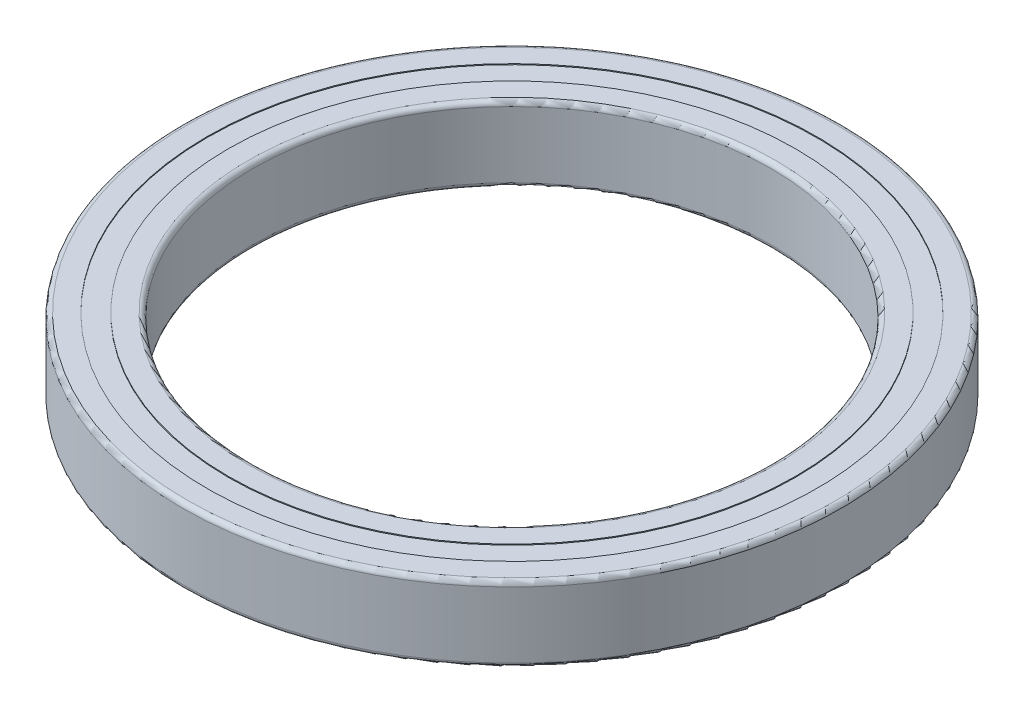
ISO-10303-21;
HEADER;
FILE_DESCRIPTION(('STEP AP214'),'2;1');
FILE_NAME('part.step','',(''),(''),'','','');
FILE_SCHEMA(('AUTOMOTIVE_DESIGN { 1 0 10303 214 1 1 1 1 }'));
ENDSEC;
DATA;
#1=APPLICATION_CONTEXT('core data for automotive mechanical design processes');
#2=APPLICATION_PROTOCOL_DEFINITION('international standard','automotive_design',2000,#1);
#3=PRODUCT_CONTEXT('',#1,'mechanical');
#4=PRODUCT('Part','Part','',(#3));
#5=PRODUCT_RELATED_PRODUCT_CATEGORY('part','',(#4));
#6=PRODUCT_DEFINITION_FORMATION('','',#4);
#7=PRODUCT_DEFINITION_CONTEXT('part definition',#1,'design');
#8=PRODUCT_DEFINITION('design','',#6,#7);
#9=PRODUCT_DEFINITION_SHAPE('','',#8);
#10=(LENGTH_UNIT() NAMED_UNIT(*) SI_UNIT(.MILLI.,.METRE.));
#11=(NAMED_UNIT(*) PLANE_ANGLE_UNIT() SI_UNIT($,.RADIAN.));
#12=(NAMED_UNIT(*) SI_UNIT($,.STERADIAN.) SOLID_ANGLE_UNIT());
#13=UNCERTAINTY_MEASURE_WITH_UNIT(LENGTH_MEASURE(1.E-05),#10,'distance_accuracy_value','');
#14=(GEOMETRIC_REPRESENTATION_CONTEXT(3) GLOBAL_UNCERTAINTY_ASSIGNED_CONTEXT((#13)) GLOBAL_UNIT_ASSIGNED_CONTEXT((#10,
#11,#12)) REPRESENTATION_CONTEXT('',''));
#15=CARTESIAN_POINT('',(0.,0.,0.));
#16=DIRECTION('',(0.,0.,1.));
#17=DIRECTION('',(1.,0.,0.));
#18=AXIS2_PLACEMENT_3D('',#15,#16,#17);
#19=CARTESIAN_POINT('',(0.,0.199999999999996,0.));
#20=DIRECTION('',(0.,1.,0.));
#21=DIRECTION('',(-1.,0.,0.));
#22=AXIS2_PLACEMENT_3D('',#19,#20,#21);
#23=CYLINDRICAL_SURFACE('',#22,64.75);
#24=CARTESIAN_POINT('',(0.,-15.8,0.));
#25=DIRECTION('',(0.,1.,0.));
#26=DIRECTION('',(-1.,0.,0.));
#27=AXIS2_PLACEMENT_3D('',#24,#25,#26);
#28=CIRCLE('',#27,64.75);
#29=CARTESIAN_POINT('',(-64.75,-15.8,0.));
#30=VERTEX_POINT('',#29);
#31=EDGE_CURVE('P0_E11',#30,#30,#28,.T.);
#32=ORIENTED_EDGE('',*,*,#31,.T.);
#33=EDGE_LOOP('',(#32));
#34=FACE_BOUND('',#33,.T.);
#35=CARTESIAN_POINT('',(0.,-15.3,0.));
#36=DIRECTION('',(0.,1.,0.));
#37=DIRECTION('',(-1.,0.,0.));
#38=AXIS2_PLACEMENT_3D('',#35,#36,#37);
#39=CIRCLE('',#38,64.75);
#40=CARTESIAN_POINT('',(-64.75,-15.3,0.));
#41=VERTEX_POINT('',#40);
#42=EDGE_CURVE('P0_E57',#41,#41,#39,.T.);
#43=ORIENTED_EDGE('',*,*,#42,.F.);
#44=EDGE_LOOP('',(#43));
#45=FACE_BOUND('',#44,.T.);
#46=ADVANCED_FACE('P0_F43',(#34,#45),#23,.T.);
#47=CARTESIAN_POINT('',(-64.75,-15.8,0.));
#48=DIRECTION('',(0.,-1.,0.));
#49=DIRECTION('',(1.,0.,0.));
#50=AXIS2_PLACEMENT_3D('',#47,#48,#49);
#51=PLANE('',#50);
#52=CARTESIAN_POINT('',(0.,-15.8,0.));
#53=DIRECTION('',(0.,1.,0.));
#54=DIRECTION('',(-1.,0.,0.));
#55=AXIS2_PLACEMENT_3D('',#52,#53,#54);
#56=CIRCLE('',#55,60.25);
#57=CARTESIAN_POINT('',(-60.25,-15.8,0.));
#58=VERTEX_POINT('',#57);
#59=EDGE_CURVE('P0_E49',#58,#58,#56,.T.);
#60=ORIENTED_EDGE('',*,*,#59,.T.);
#61=EDGE_LOOP('',(#60));
#62=FACE_BOUND('',#61,.T.);
#63=ORIENTED_EDGE('',*,*,#31,.F.);
#64=EDGE_LOOP('',(#63));
#65=FACE_BOUND('',#64,.T.);
#66=ADVANCED_FACE('P0_F67',(#62,#65),#51,.T.);
#67=CARTESIAN_POINT('',(0.,0.199999999999996,0.));
#68=DIRECTION('',(0.,1.,0.));
#69=DIRECTION('',(-1.,0.,0.));
#70=AXIS2_PLACEMENT_3D('',#67,#68,#69);
#71=CYLINDRICAL_SURFACE('',#70,60.25);
#72=CARTESIAN_POINT('',(0.,-15.3,0.));
#73=DIRECTION('',(0.,1.,0.));
#74=DIRECTION('',(-1.,0.,0.));
#75=AXIS2_PLACEMENT_3D('',#72,#73,#74);
#76=CIRCLE('',#75,60.25);
#77=CARTESIAN_POINT('',(-60.25,-15.3,0.));
#78=VERTEX_POINT('',#77);
#79=EDGE_CURVE('P0_E53',#78,#78,#76,.T.);
#80=ORIENTED_EDGE('',*,*,#79,.T.);
#81=EDGE_LOOP('',(#80));
#82=FACE_BOUND('',#81,.T.);
#83=ORIENTED_EDGE('',*,*,#59,.F.);
#84=EDGE_LOOP('',(#83));
#85=FACE_BOUND('',#84,.T.);
#86=ADVANCED_FACE('P0_F71',(#82,#85),#71,.F.);
#87=CARTESIAN_POINT('',(-64.75,-15.3,0.));
#88=DIRECTION('',(0.,1.,0.));
#89=DIRECTION('',(-1.,0.,0.));
#90=AXIS2_PLACEMENT_3D('',#87,#88,#89);
#91=PLANE('',#90);
#92=ORIENTED_EDGE('',*,*,#42,.T.);
#93=EDGE_LOOP('',(#92));
#94=FACE_BOUND('',#93,.T.);
#95=ORIENTED_EDGE('',*,*,#79,.F.);
#96=EDGE_LOOP('',(#95));
#97=FACE_BOUND('',#96,.T.);
#98=ADVANCED_FACE('P0_F63',(#94,#97),#91,.T.);
#99=CLOSED_SHELL('',(#46,#66,#86,#98));
#100=MANIFOLD_SOLID_BREP('P0_B2',#99);
#101=CARTESIAN_POINT('',(-64.75,-0.199999999999992,0.));
#102=DIRECTION('',(0.,1.,0.));
#103=DIRECTION('',(-1.,0.,0.));
#104=AXIS2_PLACEMENT_3D('',#101,#102,#103);
#105=PLANE('',#104);
#106=CARTESIAN_POINT('',(0.,-0.199999999999992,0.));
#107=DIRECTION('',(0.,1.,0.));
#108=DIRECTION('',(-1.,0.,0.));
#109=AXIS2_PLACEMENT_3D('',#106,#107,#108);
#110=CIRCLE('',#109,64.75);
#111=CARTESIAN_POINT('',(-64.75,-0.199999999999992,0.));
#112=VERTEX_POINT('',#111);
#113=EDGE_CURVE('P0_E119',#112,#112,#110,.T.);
#114=ORIENTED_EDGE('',*,*,#113,.T.);
#115=EDGE_LOOP('',(#114));
#116=FACE_BOUND('',#115,.T.);
#117=CARTESIAN_POINT('',(0.,-0.199999999999993,0.));
#118=DIRECTION('',(0.,1.,0.));
#119=DIRECTION('',(-1.,0.,0.));
#120=AXIS2_PLACEMENT_3D('',#117,#118,#119);
#121=CIRCLE('',#120,60.25);
#122=CARTESIAN_POINT('',(-60.25,-0.199999999999993,0.));
#123=VERTEX_POINT('',#122);
#124=EDGE_CURVE('P0_E42',#123,#123,#121,.T.);
#125=ORIENTED_EDGE('',*,*,#124,.F.);
#126=EDGE_LOOP('',(#125));
#127=FACE_BOUND('',#126,.T.);
#128=ADVANCED_FACE('P0_F105',(#116,#127),#105,.T.);
#129=CARTESIAN_POINT('',(0.,-0.200000000000004,0.));
#130=DIRECTION('',(0.,1.,0.));
#131=DIRECTION('',(-1.,0.,0.));
#132=AXIS2_PLACEMENT_3D('',#129,#130,#131);
#133=CYLINDRICAL_SURFACE('',#132,60.25);
#134=ORIENTED_EDGE('',*,*,#124,.T.);
#135=EDGE_LOOP('',(#134));
#136=FACE_BOUND('',#135,.T.);
#137=CARTESIAN_POINT('',(0.,-0.699999999999992,0.));
#138=DIRECTION('',(0.,1.,0.));
#139=DIRECTION('',(-1.,0.,0.));
#140=AXIS2_PLACEMENT_3D('',#137,#138,#139);
#141=CIRCLE('',#140,60.25);
#142=CARTESIAN_POINT('',(-60.25,-0.699999999999992,0.));
#143=VERTEX_POINT('',#142);
#144=EDGE_CURVE('P0_E111',#143,#143,#141,.T.);
#145=ORIENTED_EDGE('',*,*,#144,.F.);
#146=EDGE_LOOP('',(#145));
#147=FACE_BOUND('',#146,.T.);
#148=ADVANCED_FACE('P0_F135',(#136,#147),#133,.F.);
#149=CARTESIAN_POINT('',(-64.75,-0.699999999999992,0.));
#150=DIRECTION('',(0.,-1.,0.));
#151=DIRECTION('',(1.,0.,0.));
#152=AXIS2_PLACEMENT_3D('',#149,#150,#151);
#153=PLANE('',#152);
#154=ORIENTED_EDGE('',*,*,#144,.T.);
#155=EDGE_LOOP('',(#154));
#156=FACE_BOUND('',#155,.T.);
#157=CARTESIAN_POINT('',(0.,-0.699999999999992,0.));
#158=DIRECTION('',(0.,1.,0.));
#159=DIRECTION('',(-1.,0.,0.));
#160=AXIS2_PLACEMENT_3D('',#157,#158,#159);
#161=CIRCLE('',#160,64.75);
#162=CARTESIAN_POINT('',(-64.75,-0.699999999999992,0.));
#163=VERTEX_POINT('',#162);
#164=EDGE_CURVE('P0_E115',#163,#163,#161,.T.);
#165=ORIENTED_EDGE('',*,*,#164,.F.);
#166=EDGE_LOOP('',(#165));
#167=FACE_BOUND('',#166,.T.);
#168=ADVANCED_FACE('P0_F129',(#156,#167),#153,.T.);
#169=CARTESIAN_POINT('',(0.,-0.200000000000004,0.));
#170=DIRECTION('',(0.,1.,0.));
#171=DIRECTION('',(-1.,0.,0.));
#172=AXIS2_PLACEMENT_3D('',#169,#170,#171);
#173=CYLINDRICAL_SURFACE('',#172,64.75);
#174=ORIENTED_EDGE('',*,*,#164,.T.);
#175=EDGE_LOOP('',(#174));
#176=FACE_BOUND('',#175,.T.);
#177=ORIENTED_EDGE('',*,*,#113,.F.);
#178=EDGE_LOOP('',(#177));
#179=FACE_BOUND('',#178,.T.);
#180=ADVANCED_FACE('P0_F127',(#176,#179),#173,.T.);
#181=CLOSED_SHELL('',(#128,#148,#168,#180));
#182=MANIFOLD_SOLID_BREP('P0_B6',#181);
#183=CARTESIAN_POINT('',(0.,-8.,0.));
#184=DIRECTION('',(0.,1.,0.));
#185=DIRECTION('',(0.,0.,1.));
#186=AXIS2_PLACEMENT_3D('',#183,#184,#185);
#187=TOROIDAL_SURFACE('',#186,62.5,4.5);
#188=CARTESIAN_POINT('',(0.,-11.89711431703,0.));
#189=DIRECTION('',(0.,1.,0.));
#190=DIRECTION('',(-1.,0.,0.));
#191=AXIS2_PLACEMENT_3D('',#188,#189,#190);
#192=CIRCLE('',#191,64.75);
#193=CARTESIAN_POINT('',(-64.75,-11.89711431703,0.));
#194=VERTEX_POINT('',#193);
#195=EDGE_CURVE('P1_E224',#194,#194,#192,.F.);
#196=ORIENTED_EDGE('',*,*,#195,.T.);
#197=EDGE_LOOP('',(#196));
#198=FACE_BOUND('',#197,.T.);
#199=CARTESIAN_POINT('',(0.,-4.10288568297003,0.));
#200=DIRECTION('',(0.,1.,0.));
#201=DIRECTION('',(-1.,0.,0.));
#202=AXIS2_PLACEMENT_3D('',#199,#200,#201);
#203=CIRCLE('',#202,64.75);
#204=CARTESIAN_POINT('',(-64.75,-4.10288568297002,0.));
#205=VERTEX_POINT('',#204);
#206=EDGE_CURVE('P1_E227',#205,#205,#203,.T.);
#207=ORIENTED_EDGE('',*,*,#206,.T.);
#208=EDGE_LOOP('',(#207));
#209=FACE_BOUND('',#208,.T.);
#210=ADVANCED_FACE('P1_F18',(#198,#209),#187,.F.);
#211=CARTESIAN_POINT('',(0.,-13.948557158515,0.));
#212=DIRECTION('',(0.,1.,0.));
#213=DIRECTION('',(-1.,0.,0.));
#214=AXIS2_PLACEMENT_3D('',#211,#212,#213);
#215=CYLINDRICAL_SURFACE('',#214,64.75);
#216=CARTESIAN_POINT('',(0.,-16.,0.));
#217=DIRECTION('',(0.,1.,0.));
#218=DIRECTION('',(-1.,0.,0.));
#219=AXIS2_PLACEMENT_3D('',#216,#217,#218);
#220=CIRCLE('',#219,64.75);
#221=CARTESIAN_POINT('',(-64.75,-16.,0.));
#222=VERTEX_POINT('',#221);
#223=EDGE_CURVE('P1_E56',#222,#222,#220,.T.);
#224=ORIENTED_EDGE('',*,*,#223,.F.);
#225=EDGE_LOOP('',(#224));
#226=FACE_BOUND('',#225,.T.);
#227=ORIENTED_EDGE('',*,*,#195,.F.);
#228=EDGE_LOOP('',(#227));
#229=FACE_BOUND('',#228,.T.);
#230=ADVANCED_FACE('P1_F193',(#226,#229),#215,.F.);
#231=CARTESIAN_POINT('',(0.,-2.05144284148502,0.));
#232=DIRECTION('',(0.,1.,0.));
#233=DIRECTION('',(-1.,0.,0.));
#234=AXIS2_PLACEMENT_3D('',#231,#232,#233);
#235=CYLINDRICAL_SURFACE('',#234,64.75);
#236=ORIENTED_EDGE('',*,*,#206,.F.);
#237=EDGE_LOOP('',(#236));
#238=FACE_BOUND('',#237,.T.);
#239=CARTESIAN_POINT('',(0.,0.,0.));
#240=DIRECTION('',(0.,1.,0.));
#241=DIRECTION('',(-1.,0.,0.));
#242=AXIS2_PLACEMENT_3D('',#239,#240,#241);
#243=CIRCLE('',#242,64.75);
#244=CARTESIAN_POINT('',(-64.75,0.,0.));
#245=VERTEX_POINT('',#244);
#246=EDGE_CURVE('P1_E55',#245,#245,#243,.F.);
#247=ORIENTED_EDGE('',*,*,#246,.F.);
#248=EDGE_LOOP('',(#247));
#249=FACE_BOUND('',#248,.T.);
#250=ADVANCED_FACE('P1_F81',(#238,#249),#235,.F.);
#251=CARTESIAN_POINT('',(0.,-16.,66.875));
#252=DIRECTION('',(0.,-1.,0.));
#253=DIRECTION('',(0.,0.,-1.));
#254=AXIS2_PLACEMENT_3D('',#251,#252,#253);
#255=PLANE('',#254);
#256=ORIENTED_EDGE('',*,*,#223,.T.);
#257=EDGE_LOOP('',(#256));
#258=FACE_BOUND('',#257,.T.);
#259=CARTESIAN_POINT('',(0.,-16.,0.));
#260=DIRECTION('',(0.,1.,0.));
#261=DIRECTION('',(0.,0.,1.));
#262=AXIS2_PLACEMENT_3D('',#259,#260,#261);
#263=CIRCLE('',#262,69.);
#264=CARTESIAN_POINT('',(0.,-16.,69.));
#265=VERTEX_POINT('',#264);
#266=CARTESIAN_POINT('',(0.,-16.,-69.));
#267=VERTEX_POINT('',#266);
#268=EDGE_CURVE('P1_E51',#265,#267,#263,.T.);
#269=ORIENTED_EDGE('',*,*,#268,.F.);
#270=CARTESIAN_POINT('',(0.,-16.,0.));
#271=DIRECTION('',(0.,1.,0.));
#272=DIRECTION('',(0.,0.,-1.));
#273=AXIS2_PLACEMENT_3D('',#270,#271,#272);
#274=CIRCLE('',#273,69.);
#275=EDGE_CURVE('P1_E46',#267,#265,#274,.T.);
#276=ORIENTED_EDGE('',*,*,#275,.F.);
#277=EDGE_LOOP('',(#269,#276));
#278=FACE_BOUND('',#277,.T.);
#279=ADVANCED_FACE('P1_F60',(#258,#278),#255,.T.);
#280=CARTESIAN_POINT('',(0.,0.,66.875));
#281=DIRECTION('',(0.,1.,0.));
#282=DIRECTION('',(-1.,0.,0.));
#283=AXIS2_PLACEMENT_3D('',#280,#281,#282);
#284=PLANE('',#283);
#285=CARTESIAN_POINT('',(0.,0.,0.));
#286=DIRECTION('',(0.,-1.,0.));
#287=DIRECTION('',(0.,0.,-1.));
#288=AXIS2_PLACEMENT_3D('',#285,#286,#287);
#289=CIRCLE('',#288,69.);
#290=CARTESIAN_POINT('',(0.,0.,-69.));
#291=VERTEX_POINT('',#290);
#292=CARTESIAN_POINT('',(0.,0.,69.));
#293=VERTEX_POINT('',#292);
#294=EDGE_CURVE('P1_E61',#291,#293,#289,.T.);
#295=ORIENTED_EDGE('',*,*,#294,.F.);
#296=CARTESIAN_POINT('',(0.,0.,0.));
#297=DIRECTION('',(0.,-1.,0.));
#298=DIRECTION('',(0.,0.,1.));
#299=AXIS2_PLACEMENT_3D('',#296,#297,#298);
#300=CIRCLE('',#299,69.);
#301=EDGE_CURVE('P1_E36',#291,#293,#300,.F.);
#302=ORIENTED_EDGE('',*,*,#301,.T.);
#303=EDGE_LOOP('',(#295,#302));
#304=FACE_BOUND('',#303,.T.);
#305=ORIENTED_EDGE('',*,*,#246,.T.);
#306=EDGE_LOOP('',(#305));
#307=FACE_BOUND('',#306,.T.);
#308=ADVANCED_FACE('P1_F80',(#304,#307),#284,.T.);
#309=CARTESIAN_POINT('',(0.,-15.,0.));
#310=DIRECTION('',(0.,1.,0.));
#311=DIRECTION('',(0.,0.,1.));
#312=AXIS2_PLACEMENT_3D('',#309,#310,#311);
#313=TOROIDAL_SURFACE('',#312,69.,0.999999999999986);
#314=ORIENTED_EDGE('',*,*,#275,.T.);
#315=ORIENTED_EDGE('',*,*,#268,.T.);
#316=EDGE_LOOP('',(#314,#315));
#317=FACE_BOUND('',#316,.T.);
#318=CARTESIAN_POINT('',(0.,-15.,0.));
#319=DIRECTION('',(0.,1.,0.));
#320=DIRECTION('',(-1.,0.,0.));
#321=AXIS2_PLACEMENT_3D('',#318,#319,#320);
#322=CIRCLE('',#321,70.);
#323=CARTESIAN_POINT('',(-70.,-15.,0.));
#324=VERTEX_POINT('',#323);
#325=EDGE_CURVE('P1_E30',#324,#324,#322,.T.);
#326=ORIENTED_EDGE('',*,*,#325,.F.);
#327=EDGE_LOOP('',(#326));
#328=FACE_BOUND('',#327,.T.);
#329=ADVANCED_FACE('P1_F49',(#317,#328),#313,.T.);
#330=CARTESIAN_POINT('',(0.,-0.999999999999997,0.));
#331=DIRECTION('',(0.,1.,0.));
#332=DIRECTION('',(0.,0.,1.));
#333=AXIS2_PLACEMENT_3D('',#330,#331,#332);
#334=TOROIDAL_SURFACE('',#333,69.,0.999999999999993);
#335=ORIENTED_EDGE('',*,*,#294,.T.);
#336=ORIENTED_EDGE('',*,*,#301,.F.);
#337=EDGE_LOOP('',(#335,#336));
#338=FACE_BOUND('',#337,.T.);
#339=CARTESIAN_POINT('',(0.,-1.,0.));
#340=DIRECTION('',(0.,1.,0.));
#341=DIRECTION('',(-1.,0.,0.));
#342=AXIS2_PLACEMENT_3D('',#339,#340,#341);
#343=CIRCLE('',#342,70.);
#344=CARTESIAN_POINT('',(-70.,-0.999999999999987,0.));
#345=VERTEX_POINT('',#344);
#346=EDGE_CURVE('P1_E11',#345,#345,#343,.F.);
#347=ORIENTED_EDGE('',*,*,#346,.F.);
#348=EDGE_LOOP('',(#347));
#349=FACE_BOUND('',#348,.T.);
#350=ADVANCED_FACE('P1_F105',(#338,#349),#334,.T.);
#351=CARTESIAN_POINT('',(0.,-8.,0.));
#352=DIRECTION('',(0.,1.,0.));
#353=DIRECTION('',(-1.,0.,0.));
#354=AXIS2_PLACEMENT_3D('',#351,#352,#353);
#355=CYLINDRICAL_SURFACE('',#354,70.);
#356=ORIENTED_EDGE('',*,*,#325,.T.);
#357=EDGE_LOOP('',(#356));
#358=FACE_BOUND('',#357,.T.);
#359=ORIENTED_EDGE('',*,*,#346,.T.);
#360=EDGE_LOOP('',(#359));
#361=FACE_BOUND('',#360,.T.);
#362=ADVANCED_FACE('P1_F135',(#358,#361),#355,.T.);
#363=CLOSED_SHELL('',(#210,#230,#250,#279,#308,#329,#350,#362));
#364=MANIFOLD_SOLID_BREP('P1_B1',#363);
#365=CARTESIAN_POINT('',(0.,-8.,0.));
#366=DIRECTION('',(0.,1.,0.));
#367=DIRECTION('',(0.,0.,1.));
#368=AXIS2_PLACEMENT_3D('',#365,#366,#367);
#369=TOROIDAL_SURFACE('',#368,62.5,4.5);
#370=CARTESIAN_POINT('',(0.,-4.10288568297003,0.));
#371=DIRECTION('',(0.,1.,0.));
#372=DIRECTION('',(-1.,0.,0.));
#373=AXIS2_PLACEMENT_3D('',#370,#371,#372);
#374=CIRCLE('',#373,60.25);
#375=CARTESIAN_POINT('',(-60.25,-4.10288568297002,0.));
#376=VERTEX_POINT('',#375);
#377=EDGE_CURVE('P2_E216',#376,#376,#374,.T.);
#378=ORIENTED_EDGE('',*,*,#377,.F.);
#379=EDGE_LOOP('',(#378));
#380=FACE_BOUND('',#379,.T.);
#381=CARTESIAN_POINT('',(0.,-11.89711431703,0.));
#382=DIRECTION('',(0.,1.,0.));
#383=DIRECTION('',(-1.,0.,0.));
#384=AXIS2_PLACEMENT_3D('',#381,#382,#383);
#385=CIRCLE('',#384,60.25);
#386=CARTESIAN_POINT('',(-60.25,-11.89711431703,0.));
#387=VERTEX_POINT('',#386);
#388=EDGE_CURVE('P2_E219',#387,#387,#385,.F.);
#389=ORIENTED_EDGE('',*,*,#388,.F.);
#390=EDGE_LOOP('',(#389));
#391=FACE_BOUND('',#390,.T.);
#392=ADVANCED_FACE('P2_F17',(#380,#391),#369,.F.);
#393=CARTESIAN_POINT('',(0.,-2.05144284148502,0.));
#394=DIRECTION('',(0.,1.,0.));
#395=DIRECTION('',(-1.,0.,0.));
#396=AXIS2_PLACEMENT_3D('',#393,#394,#395);
#397=CYLINDRICAL_SURFACE('',#396,60.25);
#398=CARTESIAN_POINT('',(0.,0.,0.));
#399=DIRECTION('',(0.,1.,0.));
#400=DIRECTION('',(-1.,0.,0.));
#401=AXIS2_PLACEMENT_3D('',#398,#399,#400);
#402=CIRCLE('',#401,60.25);
#403=CARTESIAN_POINT('',(-60.25,0.,0.));
#404=VERTEX_POINT('',#403);
#405=EDGE_CURVE('P2_E220',#404,#404,#402,.T.);
#406=ORIENTED_EDGE('',*,*,#405,.F.);
#407=EDGE_LOOP('',(#406));
#408=FACE_BOUND('',#407,.T.);
#409=ORIENTED_EDGE('',*,*,#377,.T.);
#410=EDGE_LOOP('',(#409));
#411=FACE_BOUND('',#410,.T.);
#412=ADVANCED_FACE('P2_F155',(#408,#411),#397,.T.);
#413=CARTESIAN_POINT('',(0.,-13.948557158515,0.));
#414=DIRECTION('',(0.,1.,0.));
#415=DIRECTION('',(-1.,0.,0.));
#416=AXIS2_PLACEMENT_3D('',#413,#414,#415);
#417=CYLINDRICAL_SURFACE('',#416,60.25);
#418=ORIENTED_EDGE('',*,*,#388,.T.);
#419=EDGE_LOOP('',(#418));
#420=FACE_BOUND('',#419,.T.);
#421=CARTESIAN_POINT('',(0.,-16.,0.));
#422=DIRECTION('',(0.,1.,0.));
#423=DIRECTION('',(-1.,0.,0.));
#424=AXIS2_PLACEMENT_3D('',#421,#422,#423);
#425=CIRCLE('',#424,60.25);
#426=CARTESIAN_POINT('',(-60.25,-16.,0.));
#427=VERTEX_POINT('',#426);
#428=EDGE_CURVE('P2_E222',#427,#427,#425,.F.);
#429=ORIENTED_EDGE('',*,*,#428,.F.);
#430=EDGE_LOOP('',(#429));
#431=FACE_BOUND('',#430,.T.);
#432=ADVANCED_FACE('P2_F148',(#420,#431),#417,.T.);
#433=CARTESIAN_POINT('',(0.,0.,58.125));
#434=DIRECTION('',(0.,1.,0.));
#435=DIRECTION('',(0.,0.,1.));
#436=AXIS2_PLACEMENT_3D('',#433,#434,#435);
#437=PLANE('',#436);
#438=ORIENTED_EDGE('',*,*,#405,.T.);
#439=EDGE_LOOP('',(#438));
#440=FACE_BOUND('',#439,.T.);
#441=CARTESIAN_POINT('',(0.,0.,0.));
#442=DIRECTION('',(0.,1.,0.));
#443=DIRECTION('',(0.,0.,1.));
#444=AXIS2_PLACEMENT_3D('',#441,#442,#443);
#445=CIRCLE('',#444,56.);
#446=CARTESIAN_POINT('',(0.,0.,56.));
#447=VERTEX_POINT('',#446);
#448=CARTESIAN_POINT('',(0.,0.,-56.));
#449=VERTEX_POINT('',#448);
#450=EDGE_CURVE('P2_E48',#447,#449,#445,.T.);
#451=ORIENTED_EDGE('',*,*,#450,.F.);
#452=CARTESIAN_POINT('',(0.,0.,0.));
#453=DIRECTION('',(0.,1.,0.));
#454=DIRECTION('',(0.,0.,-1.));
#455=AXIS2_PLACEMENT_3D('',#452,#453,#454);
#456=CIRCLE('',#455,56.);
#457=EDGE_CURVE('P2_E52',#449,#447,#456,.T.);
#458=ORIENTED_EDGE('',*,*,#457,.F.);
#459=EDGE_LOOP('',(#451,#458));
#460=FACE_BOUND('',#459,.T.);
#461=ADVANCED_FACE('P2_F51',(#440,#460),#437,.T.);
#462=CARTESIAN_POINT('',(0.,-16.,58.125));
#463=DIRECTION('',(0.,-1.,0.));
#464=DIRECTION('',(0.,0.,-1.));
#465=AXIS2_PLACEMENT_3D('',#462,#463,#464);
#466=PLANE('',#465);
#467=CARTESIAN_POINT('',(0.,-16.,0.));
#468=DIRECTION('',(0.,-1.,0.));
#469=DIRECTION('',(0.,0.,-1.));
#470=AXIS2_PLACEMENT_3D('',#467,#468,#469);
#471=CIRCLE('',#470,56.);
#472=CARTESIAN_POINT('',(0.,-16.,-56.));
#473=VERTEX_POINT('',#472);
#474=CARTESIAN_POINT('',(0.,-16.,56.));
#475=VERTEX_POINT('',#474);
#476=EDGE_CURVE('P2_E39',#473,#475,#471,.T.);
#477=ORIENTED_EDGE('',*,*,#476,.F.);
#478=CARTESIAN_POINT('',(0.,-16.,0.));
#479=DIRECTION('',(0.,-1.,0.));
#480=DIRECTION('',(0.,0.,1.));
#481=AXIS2_PLACEMENT_3D('',#478,#479,#480);
#482=CIRCLE('',#481,56.);
#483=EDGE_CURVE('P2_E35',#475,#473,#482,.T.);
#484=ORIENTED_EDGE('',*,*,#483,.F.);
#485=EDGE_LOOP('',(#477,#484));
#486=FACE_BOUND('',#485,.T.);
#487=ORIENTED_EDGE('',*,*,#428,.T.);
#488=EDGE_LOOP('',(#487));
#489=FACE_BOUND('',#488,.T.);
#490=ADVANCED_FACE('P2_F79',(#486,#489),#466,.T.);
#491=CARTESIAN_POINT('',(0.,-1.,0.));
#492=DIRECTION('',(0.,1.,0.));
#493=DIRECTION('',(0.,0.,1.));
#494=AXIS2_PLACEMENT_3D('',#491,#492,#493);
#495=TOROIDAL_SURFACE('',#494,56.,1.);
#496=CARTESIAN_POINT('',(0.,-1.,0.));
#497=DIRECTION('',(0.,1.,0.));
#498=DIRECTION('',(-1.,0.,0.));
#499=AXIS2_PLACEMENT_3D('',#496,#497,#498);
#500=CIRCLE('',#499,55.);
#501=CARTESIAN_POINT('',(-55.,-0.99999999999999,0.));
#502=VERTEX_POINT('',#501);
#503=EDGE_CURVE('P2_E28',#502,#502,#500,.F.);
#504=ORIENTED_EDGE('',*,*,#503,.T.);
#505=EDGE_LOOP('',(#504));
#506=FACE_BOUND('',#505,.T.);
#507=ORIENTED_EDGE('',*,*,#457,.T.);
#508=ORIENTED_EDGE('',*,*,#450,.T.);
#509=EDGE_LOOP('',(#507,#508));
#510=FACE_BOUND('',#509,.T.);
#511=ADVANCED_FACE('P2_F58',(#506,#510),#495,.T.);
#512=CARTESIAN_POINT('',(0.,-15.,0.));
#513=DIRECTION('',(0.,1.,0.));
#514=DIRECTION('',(0.,0.,1.));
#515=AXIS2_PLACEMENT_3D('',#512,#513,#514);
#516=TOROIDAL_SURFACE('',#515,56.,1.);
#517=ORIENTED_EDGE('',*,*,#476,.T.);
#518=ORIENTED_EDGE('',*,*,#483,.T.);
#519=EDGE_LOOP('',(#517,#518));
#520=FACE_BOUND('',#519,.T.);
#521=CARTESIAN_POINT('',(0.,-15.,0.));
#522=DIRECTION('',(0.,1.,0.));
#523=DIRECTION('',(-1.,0.,0.));
#524=AXIS2_PLACEMENT_3D('',#521,#522,#523);
#525=CIRCLE('',#524,55.);
#526=CARTESIAN_POINT('',(-55.,-15.,0.));
#527=VERTEX_POINT('',#526);
#528=EDGE_CURVE('P2_E11',#527,#527,#525,.T.);
#529=ORIENTED_EDGE('',*,*,#528,.T.);
#530=EDGE_LOOP('',(#529));
#531=FACE_BOUND('',#530,.T.);
#532=ADVANCED_FACE('P2_F78',(#520,#531),#516,.T.);
#533=CARTESIAN_POINT('',(0.,-8.,0.));
#534=DIRECTION('',(0.,1.,0.));
#535=DIRECTION('',(-1.,0.,0.));
#536=AXIS2_PLACEMENT_3D('',#533,#534,#535);
#537=CYLINDRICAL_SURFACE('',#536,55.);
#538=ORIENTED_EDGE('',*,*,#528,.F.);
#539=EDGE_LOOP('',(#538));
#540=FACE_BOUND('',#539,.T.);
#541=ORIENTED_EDGE('',*,*,#503,.F.);
#542=EDGE_LOOP('',(#541));
#543=FACE_BOUND('',#542,.T.);
#544=ADVANCED_FACE('P2_F120',(#540,#543),#537,.F.);
#545=CLOSED_SHELL('',(#392,#412,#432,#461,#490,#511,#532,#544));
#546=MANIFOLD_SOLID_BREP('P2_B1',#545);
#547=ADVANCED_BREP_SHAPE_REPRESENTATION('',(#18,#100,#182,#364,#546),#14);
#548=SHAPE_DEFINITION_REPRESENTATION(#9,#547);
ENDSEC;
END-ISO-10303-21;
